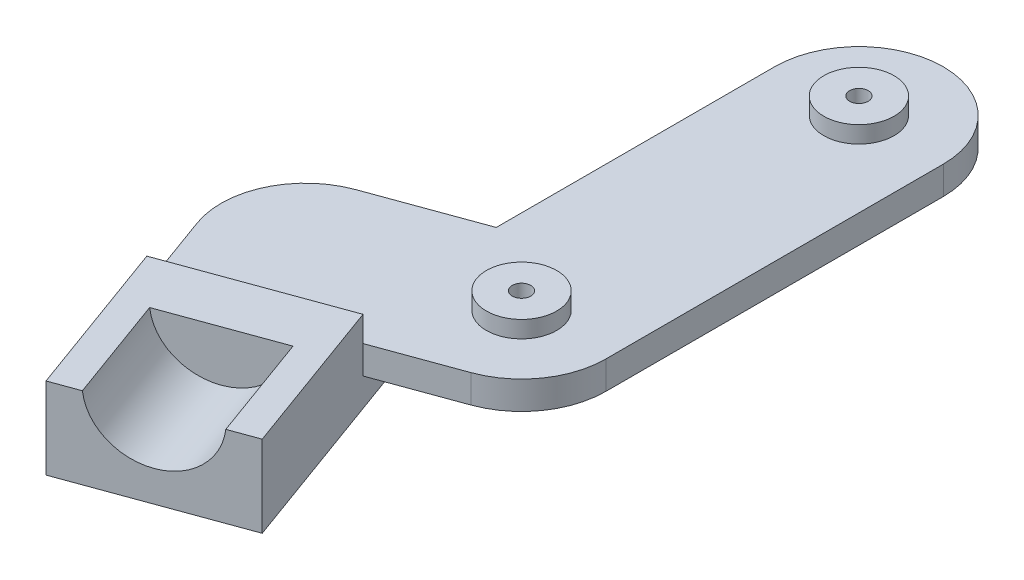
ISO-10303-21;
HEADER;
FILE_DESCRIPTION(('STEP AP214'),'2;1');
FILE_NAME('part.step','',(''),(''),'','','');
FILE_SCHEMA(('AUTOMOTIVE_DESIGN { 1 0 10303 214 1 1 1 1 }'));
ENDSEC;
DATA;
#1=APPLICATION_CONTEXT('core data for automotive mechanical design processes');
#2=APPLICATION_PROTOCOL_DEFINITION('international standard','automotive_design',2000,#1);
#3=PRODUCT_CONTEXT('',#1,'mechanical');
#4=PRODUCT('Part','Part','',(#3));
#5=PRODUCT_RELATED_PRODUCT_CATEGORY('part','',(#4));
#6=PRODUCT_DEFINITION_FORMATION('','',#4);
#7=PRODUCT_DEFINITION_CONTEXT('part definition',#1,'design');
#8=PRODUCT_DEFINITION('design','',#6,#7);
#9=PRODUCT_DEFINITION_SHAPE('','',#8);
#10=(LENGTH_UNIT() NAMED_UNIT(*) SI_UNIT(.MILLI.,.METRE.));
#11=(NAMED_UNIT(*) PLANE_ANGLE_UNIT() SI_UNIT($,.RADIAN.));
#12=(NAMED_UNIT(*) SI_UNIT($,.STERADIAN.) SOLID_ANGLE_UNIT());
#13=UNCERTAINTY_MEASURE_WITH_UNIT(LENGTH_MEASURE(1.E-05),#10,'distance_accuracy_value','');
#14=(GEOMETRIC_REPRESENTATION_CONTEXT(3) GLOBAL_UNCERTAINTY_ASSIGNED_CONTEXT((#13)) GLOBAL_UNIT_ASSIGNED_CONTEXT((#10,
#11,#12)) REPRESENTATION_CONTEXT('',''));
#15=CARTESIAN_POINT('',(0.,0.,0.));
#16=DIRECTION('',(0.,0.,1.));
#17=DIRECTION('',(1.,0.,0.));
#18=AXIS2_PLACEMENT_3D('',#15,#16,#17);
#19=CARTESIAN_POINT('',(0.,5.,0.));
#20=DIRECTION('',(0.,1.,0.));
#21=DIRECTION('',(0.,0.,1.));
#22=AXIS2_PLACEMENT_3D('',#19,#20,#21);
#23=PLANE('',#22);
#24=CARTESIAN_POINT('',(0.,5.,-60.));
#25=DIRECTION('',(0.,1.,0.));
#26=DIRECTION('',(0.,0.,1.));
#27=AXIS2_PLACEMENT_3D('',#24,#25,#26);
#28=CIRCLE('',#27,6.25000000000001);
#29=CARTESIAN_POINT('',(0.,5.,-53.75));
#30=VERTEX_POINT('',#29);
#31=EDGE_CURVE('E231',#30,#30,#28,.T.);
#32=ORIENTED_EDGE('',*,*,#31,.F.);
#33=EDGE_LOOP('',(#32));
#34=FACE_BOUND('',#33,.T.);
#35=CARTESIAN_POINT('',(0.,5.,0.));
#36=DIRECTION('',(0.,1.,0.));
#37=DIRECTION('',(0.,0.,1.));
#38=AXIS2_PLACEMENT_3D('',#35,#36,#37);
#39=CIRCLE('',#38,6.25000000000001);
#40=CARTESIAN_POINT('',(0.,5.,6.25000000000001));
#41=VERTEX_POINT('',#40);
#42=EDGE_CURVE('E227',#41,#41,#39,.T.);
#43=ORIENTED_EDGE('',*,*,#42,.F.);
#44=EDGE_LOOP('',(#43));
#45=FACE_BOUND('',#44,.T.);
#46=DIRECTION('',(-0.342020143325662,0.,-0.939692620785911));
#47=VECTOR('',#46,1.);
#48=CARTESIAN_POINT('',(-42.2861679353659,5.,15.3909064496549));
#49=LINE('',#48,#47);
#50=CARTESIAN_POINT('',(-37.155865785481,5.,29.4862957614435));
#51=VERTEX_POINT('',#50);
#52=CARTESIAN_POINT('',(-42.286167935366,5.,15.3909064496549));
#53=VERTEX_POINT('',#52);
#54=EDGE_CURVE('E172',#51,#53,#49,.T.);
#55=ORIENTED_EDGE('',*,*,#54,.F.);
#56=DIRECTION('',(-0.939692620785911,0.,0.342020143325662));
#57=VECTOR('',#56,1.);
#58=CARTESIAN_POINT('',(-8.96508716190372,5.,19.2256914616737));
#59=LINE('',#58,#57);
#60=CARTESIAN_POINT('',(-8.96508716190372,5.,19.2256914616737));
#61=VERTEX_POINT('',#60);
#62=EDGE_CURVE('E163',#61,#51,#59,.T.);
#63=ORIENTED_EDGE('',*,*,#62,.F.);
#64=DIRECTION('',(-0.939692620785909,0.,0.342020143325666));
#65=VECTOR('',#64,1.);
#66=CARTESIAN_POINT('',(5.13030214988499,5.,14.0953893117886));
#67=LINE('',#66,#65);
#68=CARTESIAN_POINT('',(5.13030214988499,5.,14.0953893117886));
#69=VERTEX_POINT('',#68);
#70=EDGE_CURVE('E198',#69,#61,#67,.T.);
#71=ORIENTED_EDGE('',*,*,#70,.F.);
#72=CARTESIAN_POINT('',(0.,5.,0.));
#73=DIRECTION('',(0.,1.,0.));
#74=DIRECTION('',(0.,0.,1.));
#75=AXIS2_PLACEMENT_3D('',#72,#73,#74);
#76=CIRCLE('',#75,15.);
#77=CARTESIAN_POINT('',(15.,5.,0.));
#78=VERTEX_POINT('',#77);
#79=EDGE_CURVE('E240',#69,#78,#76,.T.);
#80=ORIENTED_EDGE('',*,*,#79,.T.);
#81=DIRECTION('',(0.,0.,-1.));
#82=VECTOR('',#81,1.);
#83=CARTESIAN_POINT('',(15.,5.,0.));
#84=LINE('',#83,#82);
#85=CARTESIAN_POINT('',(15.,5.,-60.));
#86=VERTEX_POINT('',#85);
#87=EDGE_CURVE('E242',#78,#86,#84,.T.);
#88=ORIENTED_EDGE('',*,*,#87,.T.);
#89=CARTESIAN_POINT('',(0.,5.,-60.));
#90=DIRECTION('',(0.,1.,0.));
#91=DIRECTION('',(0.,0.,1.));
#92=AXIS2_PLACEMENT_3D('',#89,#90,#91);
#93=CIRCLE('',#92,15.);
#94=CARTESIAN_POINT('',(-15.,5.,-60.));
#95=VERTEX_POINT('',#94);
#96=EDGE_CURVE('E245',#86,#95,#93,.T.);
#97=ORIENTED_EDGE('',*,*,#96,.T.);
#98=DIRECTION('',(0.,0.,1.));
#99=VECTOR('',#98,1.);
#100=CARTESIAN_POINT('',(-15.,5.,0.));
#101=LINE('',#100,#99);
#102=CARTESIAN_POINT('',(-15.,5.,-10.5031130731457));
#103=VERTEX_POINT('',#102);
#104=EDGE_CURVE('E247',#95,#103,#101,.T.);
#105=ORIENTED_EDGE('',*,*,#104,.T.);
#106=DIRECTION('',(0.93969262078591,0.,-0.342020143325666));
#107=VECTOR('',#106,1.);
#108=CARTESIAN_POINT('',(-5.13030214988499,5.,-14.0953893117886));
#109=LINE('',#108,#107);
#110=CARTESIAN_POINT('',(-33.3210807734623,5.,-3.83478501201867));
#111=VERTEX_POINT('',#110);
#112=EDGE_CURVE('E204',#111,#103,#109,.T.);
#113=ORIENTED_EDGE('',*,*,#112,.F.);
#114=CARTESIAN_POINT('',(-28.1907786235773,5.,10.26060429977));
#115=DIRECTION('',(0.,-1.,0.));
#116=DIRECTION('',(0.,0.,-1.));
#117=AXIS2_PLACEMENT_3D('',#114,#115,#116);
#118=CIRCLE('',#117,15.);
#119=EDGE_CURVE('E201',#53,#111,#118,.T.);
#120=ORIENTED_EDGE('',*,*,#119,.F.);
#121=EDGE_LOOP('',(#55,#63,#71,#80,#88,#97,#105,#113,#120));
#122=FACE_BOUND('',#121,.T.);
#123=ADVANCED_FACE('F33',(#34,#45,#122),#23,.T.);
#124=CARTESIAN_POINT('',(0.,0.,0.));
#125=DIRECTION('',(0.,1.,0.));
#126=DIRECTION('',(0.,0.,1.));
#127=AXIS2_PLACEMENT_3D('',#124,#125,#126);
#128=PLANE('',#127);
#129=CARTESIAN_POINT('',(-28.1907786235773,0.,10.26060429977));
#130=DIRECTION('',(0.,1.,0.));
#131=DIRECTION('',(0.,0.,1.));
#132=AXIS2_PLACEMENT_3D('',#129,#130,#131);
#133=CIRCLE('',#132,15.);
#134=CARTESIAN_POINT('',(-33.3210807734623,0.,-3.83478501201867));
#135=VERTEX_POINT('',#134);
#136=CARTESIAN_POINT('',(-14.0953893117886,0.,5.13030214988504));
#137=VERTEX_POINT('',#136);
#138=EDGE_CURVE('E194',#135,#137,#133,.F.);
#139=ORIENTED_EDGE('',*,*,#138,.F.);
#140=DIRECTION('',(0.93969262078591,0.,-0.342020143325666));
#141=VECTOR('',#140,1.);
#142=CARTESIAN_POINT('',(-5.13030214988499,0.,-14.0953893117886));
#143=LINE('',#142,#141);
#144=CARTESIAN_POINT('',(-15.,0.,-10.5031130731457));
#145=VERTEX_POINT('',#144);
#146=EDGE_CURVE('E202',#135,#145,#143,.T.);
#147=ORIENTED_EDGE('',*,*,#146,.T.);
#148=DIRECTION('',(0.,0.,1.));
#149=VECTOR('',#148,1.);
#150=CARTESIAN_POINT('',(-15.,0.,0.));
#151=LINE('',#150,#149);
#152=CARTESIAN_POINT('',(-15.,0.,-60.));
#153=VERTEX_POINT('',#152);
#154=EDGE_CURVE('E243',#153,#145,#151,.T.);
#155=ORIENTED_EDGE('',*,*,#154,.F.);
#156=CARTESIAN_POINT('',(0.,0.,-60.));
#157=DIRECTION('',(0.,1.,0.));
#158=DIRECTION('',(0.,0.,1.));
#159=AXIS2_PLACEMENT_3D('',#156,#157,#158);
#160=CIRCLE('',#159,15.);
#161=CARTESIAN_POINT('',(15.,0.,-60.));
#162=VERTEX_POINT('',#161);
#163=EDGE_CURVE('E254',#162,#153,#160,.T.);
#164=ORIENTED_EDGE('',*,*,#163,.F.);
#165=DIRECTION('',(0.,0.,-1.));
#166=VECTOR('',#165,1.);
#167=CARTESIAN_POINT('',(15.,0.,0.));
#168=LINE('',#167,#166);
#169=CARTESIAN_POINT('',(15.,0.,0.));
#170=VERTEX_POINT('',#169);
#171=EDGE_CURVE('E252',#170,#162,#168,.T.);
#172=ORIENTED_EDGE('',*,*,#171,.F.);
#173=CARTESIAN_POINT('',(0.,0.,0.));
#174=DIRECTION('',(0.,1.,0.));
#175=DIRECTION('',(0.,0.,1.));
#176=AXIS2_PLACEMENT_3D('',#173,#174,#175);
#177=CIRCLE('',#176,15.);
#178=CARTESIAN_POINT('',(5.13030214988499,0.,14.0953893117886));
#179=VERTEX_POINT('',#178);
#180=EDGE_CURVE('E237',#179,#170,#177,.T.);
#181=ORIENTED_EDGE('',*,*,#180,.F.);
#182=DIRECTION('',(-0.939692620785909,0.,0.342020143325666));
#183=VECTOR('',#182,1.);
#184=CARTESIAN_POINT('',(5.13030214988499,0.,14.0953893117886));
#185=LINE('',#184,#183);
#186=CARTESIAN_POINT('',(-8.96508716190372,0.,19.2256914616737));
#187=VERTEX_POINT('',#186);
#188=EDGE_CURVE('E197',#179,#187,#185,.T.);
#189=ORIENTED_EDGE('',*,*,#188,.T.);
#190=DIRECTION('',(0.342020143325662,0.,0.939692620785911));
#191=VECTOR('',#190,1.);
#192=CARTESIAN_POINT('',(-14.0953893117887,0.,5.13030214988493));
#193=LINE('',#192,#191);
#194=EDGE_CURVE('E191',#137,#187,#193,.T.);
#195=ORIENTED_EDGE('',*,*,#194,.F.);
#196=EDGE_LOOP('',(#139,#147,#155,#164,#172,#181,#189,#195));
#197=FACE_BOUND('',#196,.T.);
#198=ADVANCED_FACE('F296',(#197),#128,.F.);
#199=CARTESIAN_POINT('',(-28.1907786235773,5.,10.26060429977));
#200=DIRECTION('',(0.,-1.,0.));
#201=DIRECTION('',(0.,0.,-1.));
#202=AXIS2_PLACEMENT_3D('',#199,#200,#201);
#203=CYLINDRICAL_SURFACE('',#202,15.);
#204=DIRECTION('',(0.,-1.,0.));
#205=VECTOR('',#204,1.);
#206=CARTESIAN_POINT('',(-33.3210807734623,5.,-3.83478501201867));
#207=LINE('',#206,#205);
#208=EDGE_CURVE('E212',#111,#135,#207,.T.);
#209=ORIENTED_EDGE('',*,*,#208,.T.);
#210=ORIENTED_EDGE('',*,*,#138,.T.);
#211=DIRECTION('',(0.,1.,0.));
#212=VECTOR('',#211,1.);
#213=CARTESIAN_POINT('',(-14.0953893117886,-5.,5.13030214988504));
#214=LINE('',#213,#212);
#215=CARTESIAN_POINT('',(-14.0953893117886,-5.,5.13030214988504));
#216=VERTEX_POINT('',#215);
#217=EDGE_CURVE('E188',#216,#137,#214,.T.);
#218=ORIENTED_EDGE('',*,*,#217,.F.);
#219=CARTESIAN_POINT('',(-28.1907786235773,-5.,10.26060429977));
#220=DIRECTION('',(0.,-1.,0.));
#221=DIRECTION('',(0.,0.,-1.));
#222=AXIS2_PLACEMENT_3D('',#219,#220,#221);
#223=CIRCLE('',#222,15.);
#224=CARTESIAN_POINT('',(-42.2861679353659,-5.,15.3909064496549));
#225=VERTEX_POINT('',#224);
#226=EDGE_CURVE('E174',#225,#216,#223,.T.);
#227=ORIENTED_EDGE('',*,*,#226,.F.);
#228=DIRECTION('',(0.,-1.,0.));
#229=VECTOR('',#228,1.);
#230=CARTESIAN_POINT('',(-42.286167935366,5.,15.3909064496549));
#231=LINE('',#230,#229);
#232=EDGE_CURVE('E270',#225,#53,#231,.F.);
#233=ORIENTED_EDGE('',*,*,#232,.T.);
#234=ORIENTED_EDGE('',*,*,#119,.T.);
#235=EDGE_LOOP('',(#209,#210,#218,#227,#233,#234));
#236=FACE_BOUND('',#235,.T.);
#237=ADVANCED_FACE('F293',(#236),#203,.T.);
#238=CARTESIAN_POINT('',(5.13030214988499,5.,14.0953893117886));
#239=DIRECTION('',(0.342020143325666,0.,0.939692620785909));
#240=DIRECTION('',(0.93969262078591,0.,-0.342020143325666));
#241=AXIS2_PLACEMENT_3D('',#238,#239,#240);
#242=PLANE('',#241);
#243=ORIENTED_EDGE('',*,*,#70,.T.);
#244=DIRECTION('',(0.,-1.,0.));
#245=VECTOR('',#244,1.);
#246=CARTESIAN_POINT('',(-8.96508716190372,5.,19.2256914616737));
#247=LINE('',#246,#245);
#248=EDGE_CURVE('E268',#61,#187,#247,.T.);
#249=ORIENTED_EDGE('',*,*,#248,.T.);
#250=ORIENTED_EDGE('',*,*,#188,.F.);
#251=DIRECTION('',(0.,-1.,0.));
#252=VECTOR('',#251,1.);
#253=CARTESIAN_POINT('',(5.13030214988499,5.,14.0953893117886));
#254=LINE('',#253,#252);
#255=EDGE_CURVE('E207',#69,#179,#254,.T.);
#256=ORIENTED_EDGE('',*,*,#255,.F.);
#257=EDGE_LOOP('',(#243,#249,#250,#256));
#258=FACE_BOUND('',#257,.T.);
#259=ADVANCED_FACE('F302',(#258),#242,.T.);
#260=CARTESIAN_POINT('',(0.,8.,0.));
#261=DIRECTION('',(0.,1.,0.));
#262=DIRECTION('',(0.,0.,1.));
#263=AXIS2_PLACEMENT_3D('',#260,#261,#262);
#264=CYLINDRICAL_SURFACE('',#263,1.64999999999999);
#265=CARTESIAN_POINT('',(0.,8.,0.));
#266=DIRECTION('',(0.,1.,0.));
#267=DIRECTION('',(0.,0.,1.));
#268=AXIS2_PLACEMENT_3D('',#265,#266,#267);
#269=CIRCLE('',#268,1.64999999999999);
#270=CARTESIAN_POINT('',(0.,8.,1.64999999999999));
#271=VERTEX_POINT('',#270);
#272=EDGE_CURVE('E218',#271,#271,#269,.T.);
#273=ORIENTED_EDGE('',*,*,#272,.T.);
#274=EDGE_LOOP('',(#273));
#275=FACE_BOUND('',#274,.T.);
#276=CARTESIAN_POINT('',(0.,5.,0.));
#277=DIRECTION('',(0.,-1.,0.));
#278=DIRECTION('',(0.,0.,-1.));
#279=AXIS2_PLACEMENT_3D('',#276,#277,#278);
#280=CIRCLE('',#279,1.64999999999999);
#281=CARTESIAN_POINT('',(0.,5.,-1.64999999999999));
#282=VERTEX_POINT('',#281);
#283=EDGE_CURVE('E265',#282,#282,#280,.F.);
#284=ORIENTED_EDGE('',*,*,#283,.F.);
#285=EDGE_LOOP('',(#284));
#286=FACE_BOUND('',#285,.T.);
#287=ADVANCED_FACE('F327',(#275,#286),#264,.F.);
#288=CARTESIAN_POINT('',(0.,5.,0.));
#289=DIRECTION('',(0.,-1.,0.));
#290=DIRECTION('',(0.,0.,-1.));
#291=AXIS2_PLACEMENT_3D('',#288,#289,#290);
#292=CYLINDRICAL_SURFACE('',#291,15.);
#293=ORIENTED_EDGE('',*,*,#79,.F.);
#294=ORIENTED_EDGE('',*,*,#255,.T.);
#295=ORIENTED_EDGE('',*,*,#180,.T.);
#296=DIRECTION('',(0.,-1.,0.));
#297=VECTOR('',#296,1.);
#298=CARTESIAN_POINT('',(15.,5.,0.));
#299=LINE('',#298,#297);
#300=EDGE_CURVE('E262',#78,#170,#299,.T.);
#301=ORIENTED_EDGE('',*,*,#300,.F.);
#302=EDGE_LOOP('',(#293,#294,#295,#301));
#303=FACE_BOUND('',#302,.T.);
#304=ADVANCED_FACE('F35',(#303),#292,.T.);
#305=CARTESIAN_POINT('',(15.,5.,0.));
#306=DIRECTION('',(-1.,0.,0.));
#307=DIRECTION('',(0.,0.,1.));
#308=AXIS2_PLACEMENT_3D('',#305,#306,#307);
#309=PLANE('',#308);
#310=ORIENTED_EDGE('',*,*,#171,.T.);
#311=DIRECTION('',(0.,-1.,0.));
#312=VECTOR('',#311,1.);
#313=CARTESIAN_POINT('',(15.,5.,-60.));
#314=LINE('',#313,#312);
#315=EDGE_CURVE('E259',#86,#162,#314,.T.);
#316=ORIENTED_EDGE('',*,*,#315,.F.);
#317=ORIENTED_EDGE('',*,*,#87,.F.);
#318=ORIENTED_EDGE('',*,*,#300,.T.);
#319=EDGE_LOOP('',(#310,#316,#317,#318));
#320=FACE_BOUND('',#319,.T.);
#321=ADVANCED_FACE('F323',(#320),#309,.F.);
#322=CARTESIAN_POINT('',(0.,5.,-60.));
#323=DIRECTION('',(0.,-1.,0.));
#324=DIRECTION('',(0.,0.,-1.));
#325=AXIS2_PLACEMENT_3D('',#322,#323,#324);
#326=CYLINDRICAL_SURFACE('',#325,15.);
#327=ORIENTED_EDGE('',*,*,#163,.T.);
#328=DIRECTION('',(0.,-1.,0.));
#329=VECTOR('',#328,1.);
#330=CARTESIAN_POINT('',(-15.,5.,-60.));
#331=LINE('',#330,#329);
#332=EDGE_CURVE('E250',#95,#153,#331,.T.);
#333=ORIENTED_EDGE('',*,*,#332,.F.);
#334=ORIENTED_EDGE('',*,*,#96,.F.);
#335=ORIENTED_EDGE('',*,*,#315,.T.);
#336=EDGE_LOOP('',(#327,#333,#334,#335));
#337=FACE_BOUND('',#336,.T.);
#338=ADVANCED_FACE('F320',(#337),#326,.T.);
#339=CARTESIAN_POINT('',(-15.,5.,0.));
#340=DIRECTION('',(1.,0.,0.));
#341=DIRECTION('',(0.,0.,-1.));
#342=AXIS2_PLACEMENT_3D('',#339,#340,#341);
#343=PLANE('',#342);
#344=ORIENTED_EDGE('',*,*,#154,.T.);
#345=DIRECTION('',(0.,1.,0.));
#346=VECTOR('',#345,1.);
#347=CARTESIAN_POINT('',(-15.,5.,-10.5031130731457));
#348=LINE('',#347,#346);
#349=EDGE_CURVE('E215',#145,#103,#348,.T.);
#350=ORIENTED_EDGE('',*,*,#349,.T.);
#351=ORIENTED_EDGE('',*,*,#104,.F.);
#352=ORIENTED_EDGE('',*,*,#332,.T.);
#353=EDGE_LOOP('',(#344,#350,#351,#352));
#354=FACE_BOUND('',#353,.T.);
#355=ADVANCED_FACE('F315',(#354),#343,.F.);
#356=CARTESIAN_POINT('',(0.,8.,-60.));
#357=DIRECTION('',(0.,-1.,0.));
#358=DIRECTION('',(0.,0.,-1.));
#359=AXIS2_PLACEMENT_3D('',#356,#357,#358);
#360=CYLINDRICAL_SURFACE('',#359,6.25000000000001);
#361=CARTESIAN_POINT('',(0.,8.,-60.));
#362=DIRECTION('',(0.,1.,0.));
#363=DIRECTION('',(0.,0.,1.));
#364=AXIS2_PLACEMENT_3D('',#361,#362,#363);
#365=CIRCLE('',#364,6.25000000000001);
#366=CARTESIAN_POINT('',(0.,8.,-53.75));
#367=VERTEX_POINT('',#366);
#368=EDGE_CURVE('E234',#367,#367,#365,.T.);
#369=ORIENTED_EDGE('',*,*,#368,.F.);
#370=EDGE_LOOP('',(#369));
#371=FACE_BOUND('',#370,.T.);
#372=ORIENTED_EDGE('',*,*,#31,.T.);
#373=EDGE_LOOP('',(#372));
#374=FACE_BOUND('',#373,.T.);
#375=ADVANCED_FACE('F344',(#371,#374),#360,.T.);
#376=CARTESIAN_POINT('',(0.,8.,-60.));
#377=DIRECTION('',(0.,1.,0.));
#378=DIRECTION('',(0.,0.,1.));
#379=AXIS2_PLACEMENT_3D('',#376,#377,#378);
#380=PLANE('',#379);
#381=CARTESIAN_POINT('',(0.,8.,-60.));
#382=DIRECTION('',(0.,1.,0.));
#383=DIRECTION('',(0.,0.,1.));
#384=AXIS2_PLACEMENT_3D('',#381,#382,#383);
#385=CIRCLE('',#384,1.64999999999999);
#386=CARTESIAN_POINT('',(0.,8.,-58.35));
#387=VERTEX_POINT('',#386);
#388=EDGE_CURVE('E221',#387,#387,#385,.T.);
#389=ORIENTED_EDGE('',*,*,#388,.F.);
#390=EDGE_LOOP('',(#389));
#391=FACE_BOUND('',#390,.T.);
#392=ORIENTED_EDGE('',*,*,#368,.T.);
#393=EDGE_LOOP('',(#392));
#394=FACE_BOUND('',#393,.T.);
#395=ADVANCED_FACE('F365',(#391,#394),#380,.T.);
#396=CARTESIAN_POINT('',(0.,8.,0.));
#397=DIRECTION('',(0.,-1.,0.));
#398=DIRECTION('',(0.,0.,-1.));
#399=AXIS2_PLACEMENT_3D('',#396,#397,#398);
#400=CYLINDRICAL_SURFACE('',#399,6.25000000000001);
#401=CARTESIAN_POINT('',(0.,8.,0.));
#402=DIRECTION('',(0.,1.,0.));
#403=DIRECTION('',(0.,0.,1.));
#404=AXIS2_PLACEMENT_3D('',#401,#402,#403);
#405=CIRCLE('',#404,6.25000000000001);
#406=CARTESIAN_POINT('',(0.,8.,6.25000000000001));
#407=VERTEX_POINT('',#406);
#408=EDGE_CURVE('E228',#407,#407,#405,.T.);
#409=ORIENTED_EDGE('',*,*,#408,.F.);
#410=EDGE_LOOP('',(#409));
#411=FACE_BOUND('',#410,.T.);
#412=ORIENTED_EDGE('',*,*,#42,.T.);
#413=EDGE_LOOP('',(#412));
#414=FACE_BOUND('',#413,.T.);
#415=ADVANCED_FACE('F373',(#411,#414),#400,.T.);
#416=CARTESIAN_POINT('',(0.,8.,0.));
#417=DIRECTION('',(0.,1.,0.));
#418=DIRECTION('',(0.,0.,1.));
#419=AXIS2_PLACEMENT_3D('',#416,#417,#418);
#420=PLANE('',#419);
#421=ORIENTED_EDGE('',*,*,#272,.F.);
#422=EDGE_LOOP('',(#421));
#423=FACE_BOUND('',#422,.T.);
#424=ORIENTED_EDGE('',*,*,#408,.T.);
#425=EDGE_LOOP('',(#424));
#426=FACE_BOUND('',#425,.T.);
#427=ADVANCED_FACE('F380',(#423,#426),#420,.T.);
#428=CARTESIAN_POINT('',(0.,3.,-60.));
#429=DIRECTION('',(0.,1.,0.));
#430=DIRECTION('',(0.,0.,1.));
#431=AXIS2_PLACEMENT_3D('',#428,#429,#430);
#432=CONICAL_SURFACE('',#431,1.65,1.02974425867665);
#433=CARTESIAN_POINT('',(0.,2.00857997860452,-60.));
#434=VERTEX_POINT('',#433);
#435=VERTEX_LOOP('',#434);
#436=FACE_BOUND('',#435,.T.);
#437=CARTESIAN_POINT('',(0.,3.,-60.));
#438=DIRECTION('',(0.,1.,0.));
#439=DIRECTION('',(0.,0.,1.));
#440=AXIS2_PLACEMENT_3D('',#437,#438,#439);
#441=CIRCLE('',#440,1.65);
#442=CARTESIAN_POINT('',(0.,3.,-58.35));
#443=VERTEX_POINT('',#442);
#444=EDGE_CURVE('E224',#443,#443,#441,.T.);
#445=ORIENTED_EDGE('',*,*,#444,.T.);
#446=EDGE_LOOP('',(#445));
#447=FACE_BOUND('',#446,.T.);
#448=ADVANCED_FACE('F387',(#436,#447),#432,.F.);
#449=CARTESIAN_POINT('',(0.,8.,-60.));
#450=DIRECTION('',(0.,1.,0.));
#451=DIRECTION('',(0.,0.,1.));
#452=AXIS2_PLACEMENT_3D('',#449,#450,#451);
#453=CYLINDRICAL_SURFACE('',#452,1.64999999999999);
#454=ORIENTED_EDGE('',*,*,#444,.F.);
#455=EDGE_LOOP('',(#454));
#456=FACE_BOUND('',#455,.T.);
#457=ORIENTED_EDGE('',*,*,#388,.T.);
#458=EDGE_LOOP('',(#457));
#459=FACE_BOUND('',#458,.T.);
#460=ADVANCED_FACE('F395',(#456,#459),#453,.F.);
#461=CARTESIAN_POINT('',(0.,5.,0.));
#462=DIRECTION('',(0.,-1.,0.));
#463=DIRECTION('',(0.,0.,-1.));
#464=AXIS2_PLACEMENT_3D('',#461,#462,#463);
#465=PLANE('',#464);
#466=ORIENTED_EDGE('',*,*,#283,.T.);
#467=EDGE_LOOP('',(#466));
#468=FACE_BOUND('',#467,.T.);
#469=ADVANCED_FACE('F403',(#468),#465,.F.);
#470=CARTESIAN_POINT('',(-5.13030214988499,5.,-14.0953893117886));
#471=DIRECTION('',(-0.342020143325666,0.,-0.939692620785909));
#472=DIRECTION('',(-0.93969262078591,0.,0.342020143325666));
#473=AXIS2_PLACEMENT_3D('',#470,#471,#472);
#474=PLANE('',#473);
#475=ORIENTED_EDGE('',*,*,#349,.F.);
#476=ORIENTED_EDGE('',*,*,#146,.F.);
#477=ORIENTED_EDGE('',*,*,#208,.F.);
#478=ORIENTED_EDGE('',*,*,#112,.T.);
#479=EDGE_LOOP('',(#475,#476,#477,#478));
#480=FACE_BOUND('',#479,.T.);
#481=ADVANCED_FACE('F311',(#480),#474,.T.);
#482=CARTESIAN_POINT('',(-14.0953893117886,-5.,5.13030214988504));
#483=DIRECTION('',(-0.939692620785911,0.,0.342020143325662));
#484=DIRECTION('',(0.342020143325662,0.,0.939692620785911));
#485=AXIS2_PLACEMENT_3D('',#482,#483,#484);
#486=PLANE('',#485);
#487=ORIENTED_EDGE('',*,*,#217,.T.);
#488=ORIENTED_EDGE('',*,*,#194,.T.);
#489=ORIENTED_EDGE('',*,*,#248,.F.);
#490=DIRECTION('',(0.,-1.,0.));
#491=VECTOR('',#490,1.);
#492=CARTESIAN_POINT('',(-8.96508716190372,9.5,19.2256914616737));
#493=LINE('',#492,#491);
#494=CARTESIAN_POINT('',(-8.96508716190372,9.5,19.2256914616737));
#495=VERTEX_POINT('',#494);
#496=EDGE_CURVE('E170',#495,#61,#493,.T.);
#497=ORIENTED_EDGE('',*,*,#496,.F.);
#498=DIRECTION('',(-0.342020143325662,0.,-0.939692620785911));
#499=VECTOR('',#498,1.);
#500=CARTESIAN_POINT('',(-8.96508716190372,9.5,19.2256914616737));
#501=LINE('',#500,#499);
#502=CARTESIAN_POINT('',(1.29551713786616,9.5,47.416470085251));
#503=VERTEX_POINT('',#502);
#504=EDGE_CURVE('E159',#503,#495,#501,.T.);
#505=ORIENTED_EDGE('',*,*,#504,.F.);
#506=DIRECTION('',(0.,1.,0.));
#507=VECTOR('',#506,1.);
#508=CARTESIAN_POINT('',(1.29551713786616,-5.,47.416470085251));
#509=LINE('',#508,#507);
#510=CARTESIAN_POINT('',(1.29551713786616,-5.,47.416470085251));
#511=VERTEX_POINT('',#510);
#512=EDGE_CURVE('E186',#511,#503,#509,.T.);
#513=ORIENTED_EDGE('',*,*,#512,.F.);
#514=DIRECTION('',(0.342020143325662,0.,0.939692620785911));
#515=VECTOR('',#514,1.);
#516=CARTESIAN_POINT('',(-14.0953893117886,-5.,5.13030214988504));
#517=LINE('',#516,#515);
#518=EDGE_CURVE('E177',#216,#511,#517,.T.);
#519=ORIENTED_EDGE('',*,*,#518,.F.);
#520=EDGE_LOOP('',(#487,#488,#489,#497,#505,#513,#519));
#521=FACE_BOUND('',#520,.T.);
#522=ADVANCED_FACE('F279',(#521),#486,.F.);
#523=CARTESIAN_POINT('',(-26.8952614857111,-5.,57.6770743850209));
#524=DIRECTION('',(-0.342020143325662,0.,-0.939692620785911));
#525=DIRECTION('',(-0.939692620785911,0.,0.342020143325662));
#526=AXIS2_PLACEMENT_3D('',#523,#524,#525);
#527=PLANE('',#526);
#528=DIRECTION('',(0.939692620785911,0.,-0.342020143325662));
#529=VECTOR('',#528,1.);
#530=CARTESIAN_POINT('',(1.29551713786616,9.5,47.416470085251));
#531=LINE('',#530,#529);
#532=CARTESIAN_POINT('',(-3.45004864968473,9.5,49.1437147766716));
#533=VERTEX_POINT('',#532);
#534=EDGE_CURVE('E154',#533,#503,#531,.T.);
#535=ORIENTED_EDGE('',*,*,#534,.F.);
#536=CARTESIAN_POINT('',(-12.7998721739225,10.5,52.546772235136));
#537=DIRECTION('',(0.342020143325662,0.,0.939692620785911));
#538=DIRECTION('',(0.939692620785911,0.,-0.342020143325662));
#539=AXIS2_PLACEMENT_3D('',#536,#537,#538);
#540=CIRCLE('',#539,10.);
#541=CARTESIAN_POINT('',(-22.1496956981603,9.5,55.9498296936003));
#542=VERTEX_POINT('',#541);
#543=EDGE_CURVE('E142',#542,#533,#540,.T.);
#544=ORIENTED_EDGE('',*,*,#543,.F.);
#545=CARTESIAN_POINT('',(-26.8952614857111,9.5,57.6770743850209));
#546=VERTEX_POINT('',#545);
#547=EDGE_CURVE('E152',#546,#542,#531,.T.);
#548=ORIENTED_EDGE('',*,*,#547,.F.);
#549=DIRECTION('',(0.,1.,0.));
#550=VECTOR('',#549,1.);
#551=CARTESIAN_POINT('',(-26.8952614857111,-5.,57.6770743850209));
#552=LINE('',#551,#550);
#553=CARTESIAN_POINT('',(-26.8952614857111,-5.,57.6770743850209));
#554=VERTEX_POINT('',#553);
#555=EDGE_CURVE('E184',#554,#546,#552,.T.);
#556=ORIENTED_EDGE('',*,*,#555,.F.);
#557=DIRECTION('',(-0.939692620785911,0.,0.342020143325662));
#558=VECTOR('',#557,1.);
#559=CARTESIAN_POINT('',(-26.8952614857111,-5.,57.6770743850209));
#560=LINE('',#559,#558);
#561=EDGE_CURVE('E179',#511,#554,#560,.T.);
#562=ORIENTED_EDGE('',*,*,#561,.F.);
#563=ORIENTED_EDGE('',*,*,#512,.T.);
#564=EDGE_LOOP('',(#535,#544,#548,#556,#562,#563));
#565=FACE_BOUND('',#564,.T.);
#566=ADVANCED_FACE('F150',(#565),#527,.F.);
#567=CARTESIAN_POINT('',(-42.2861679353659,-5.,15.3909064496549));
#568=DIRECTION('',(0.939692620785911,0.,-0.342020143325662));
#569=DIRECTION('',(-0.342020143325662,0.,-0.939692620785911));
#570=AXIS2_PLACEMENT_3D('',#567,#568,#569);
#571=PLANE('',#570);
#572=ORIENTED_EDGE('',*,*,#555,.T.);
#573=DIRECTION('',(0.342020143325662,0.,0.939692620785911));
#574=VECTOR('',#573,1.);
#575=CARTESIAN_POINT('',(-26.8952614857111,9.5,57.6770743850209));
#576=LINE('',#575,#574);
#577=CARTESIAN_POINT('',(-37.155865785481,9.5,29.4862957614435));
#578=VERTEX_POINT('',#577);
#579=EDGE_CURVE('E158',#578,#546,#576,.T.);
#580=ORIENTED_EDGE('',*,*,#579,.F.);
#581=DIRECTION('',(0.,-1.,0.));
#582=VECTOR('',#581,1.);
#583=CARTESIAN_POINT('',(-37.155865785481,9.5,29.4862957614435));
#584=LINE('',#583,#582);
#585=EDGE_CURVE('E55',#578,#51,#584,.T.);
#586=ORIENTED_EDGE('',*,*,#585,.T.);
#587=ORIENTED_EDGE('',*,*,#54,.T.);
#588=ORIENTED_EDGE('',*,*,#232,.F.);
#589=DIRECTION('',(-0.342020143325662,0.,-0.939692620785911));
#590=VECTOR('',#589,1.);
#591=CARTESIAN_POINT('',(-42.2861679353659,-5.,15.3909064496549));
#592=LINE('',#591,#590);
#593=EDGE_CURVE('E181',#554,#225,#592,.T.);
#594=ORIENTED_EDGE('',*,*,#593,.F.);
#595=EDGE_LOOP('',(#572,#580,#586,#587,#588,#594));
#596=FACE_BOUND('',#595,.T.);
#597=ADVANCED_FACE('F286',(#596),#571,.F.);
#598=CARTESIAN_POINT('',(-28.1907786235773,-5.,10.26060429977));
#599=DIRECTION('',(0.,-1.,0.));
#600=DIRECTION('',(0.,0.,-1.));
#601=AXIS2_PLACEMENT_3D('',#598,#599,#600);
#602=PLANE('',#601);
#603=ORIENTED_EDGE('',*,*,#226,.T.);
#604=ORIENTED_EDGE('',*,*,#518,.T.);
#605=ORIENTED_EDGE('',*,*,#561,.T.);
#606=ORIENTED_EDGE('',*,*,#593,.T.);
#607=EDGE_LOOP('',(#603,#604,#605,#606));
#608=FACE_BOUND('',#607,.T.);
#609=ADVANCED_FACE('F290',(#608),#602,.T.);
#610=CARTESIAN_POINT('',(-8.96508716190372,9.5,19.2256914616737));
#611=DIRECTION('',(0.342020143325662,0.,0.939692620785911));
#612=DIRECTION('',(0.939692620785911,0.,-0.342020143325662));
#613=AXIS2_PLACEMENT_3D('',#610,#611,#612);
#614=PLANE('',#613);
#615=ORIENTED_EDGE('',*,*,#62,.T.);
#616=ORIENTED_EDGE('',*,*,#585,.F.);
#617=DIRECTION('',(-0.939692620785911,0.,0.342020143325662));
#618=VECTOR('',#617,1.);
#619=CARTESIAN_POINT('',(-8.96508716190372,9.5,19.2256914616737));
#620=LINE('',#619,#618);
#621=EDGE_CURVE('E161',#495,#578,#620,.T.);
#622=ORIENTED_EDGE('',*,*,#621,.F.);
#623=ORIENTED_EDGE('',*,*,#496,.T.);
#624=EDGE_LOOP('',(#615,#616,#622,#623));
#625=FACE_BOUND('',#624,.T.);
#626=ADVANCED_FACE('F284',(#625),#614,.F.);
#627=CARTESIAN_POINT('',(0.,9.5,0.));
#628=DIRECTION('',(0.,-1.,0.));
#629=DIRECTION('',(0.,0.,-1.));
#630=AXIS2_PLACEMENT_3D('',#627,#628,#629);
#631=PLANE('',#630);
#632=DIRECTION('',(-0.939692620785911,0.,0.342020143325662));
#633=VECTOR('',#632,1.);
#634=CARTESIAN_POINT('',(8.55050358314159,9.5,23.4923155196479));
#635=LINE('',#634,#633);
#636=CARTESIAN_POINT('',(-10.290451516198,9.5,30.3498623609533));
#637=VERTEX_POINT('',#636);
#638=CARTESIAN_POINT('',(-28.9900985646735,9.5,37.1559772778821));
#639=VERTEX_POINT('',#638);
#640=EDGE_CURVE('E146',#637,#639,#635,.T.);
#641=ORIENTED_EDGE('',*,*,#640,.F.);
#642=DIRECTION('',(0.342020143325662,0.,0.939692620785911));
#643=VECTOR('',#642,1.);
#644=CARTESIAN_POINT('',(-10.290451516198,9.5,30.3498623609533));
#645=LINE('',#644,#643);
#646=EDGE_CURVE('E11',#637,#533,#645,.T.);
#647=ORIENTED_EDGE('',*,*,#646,.T.);
#648=ORIENTED_EDGE('',*,*,#534,.T.);
#649=ORIENTED_EDGE('',*,*,#504,.T.);
#650=ORIENTED_EDGE('',*,*,#621,.T.);
#651=ORIENTED_EDGE('',*,*,#579,.T.);
#652=ORIENTED_EDGE('',*,*,#547,.T.);
#653=DIRECTION('',(0.342020143325662,0.,0.939692620785911));
#654=VECTOR('',#653,1.);
#655=CARTESIAN_POINT('',(-28.9900985646735,9.5,37.1559772778821));
#656=LINE('',#655,#654);
#657=EDGE_CURVE('E41',#542,#639,#656,.F.);
#658=ORIENTED_EDGE('',*,*,#657,.T.);
#659=EDGE_LOOP('',(#641,#647,#648,#649,#650,#651,#652,#658));
#660=FACE_BOUND('',#659,.T.);
#661=ADVANCED_FACE('F157',(#660),#631,.F.);
#662=CARTESIAN_POINT('',(-19.6402750404357,10.5,33.7529198194177));
#663=DIRECTION('',(0.342020143325662,0.,0.939692620785911));
#664=DIRECTION('',(0.939692620785911,0.,-0.342020143325662));
#665=AXIS2_PLACEMENT_3D('',#662,#663,#664);
#666=CYLINDRICAL_SURFACE('',#665,10.);
#667=CARTESIAN_POINT('',(-19.6402750404357,10.5,33.7529198194177));
#668=DIRECTION('',(0.342020143325662,0.,0.939692620785911));
#669=DIRECTION('',(0.939692620785911,0.,-0.342020143325662));
#670=AXIS2_PLACEMENT_3D('',#667,#668,#669);
#671=CIRCLE('',#670,10.);
#672=EDGE_CURVE('E47',#639,#637,#671,.T.);
#673=ORIENTED_EDGE('',*,*,#672,.F.);
#674=ORIENTED_EDGE('',*,*,#657,.F.);
#675=ORIENTED_EDGE('',*,*,#543,.T.);
#676=ORIENTED_EDGE('',*,*,#646,.F.);
#677=EDGE_LOOP('',(#673,#674,#675,#676));
#678=FACE_BOUND('',#677,.T.);
#679=ADVANCED_FACE('F141',(#678),#666,.F.);
#680=CARTESIAN_POINT('',(-19.6402750404357,10.5,33.7529198194177));
#681=DIRECTION('',(0.342020143325662,0.,0.939692620785911));
#682=DIRECTION('',(0.939692620785911,0.,-0.342020143325662));
#683=AXIS2_PLACEMENT_3D('',#680,#681,#682);
#684=PLANE('',#683);
#685=ORIENTED_EDGE('',*,*,#640,.T.);
#686=ORIENTED_EDGE('',*,*,#672,.T.);
#687=EDGE_LOOP('',(#685,#686));
#688=FACE_BOUND('',#687,.T.);
#689=ADVANCED_FACE('F273',(#688),#684,.T.);
#690=CLOSED_SHELL('',(#123,#198,#237,#259,#287,#304,#321,#338,#355,#375,#395,#415,#427,#448,
#460,#469,#481,#522,#566,#597,#609,#626,#661,#679,#689));
#691=MANIFOLD_SOLID_BREP('B2',#690);
#692=ADVANCED_BREP_SHAPE_REPRESENTATION('',(#18,#691),#14);
#693=SHAPE_DEFINITION_REPRESENTATION(#9,#692);
ENDSEC;
END-ISO-10303-21;
